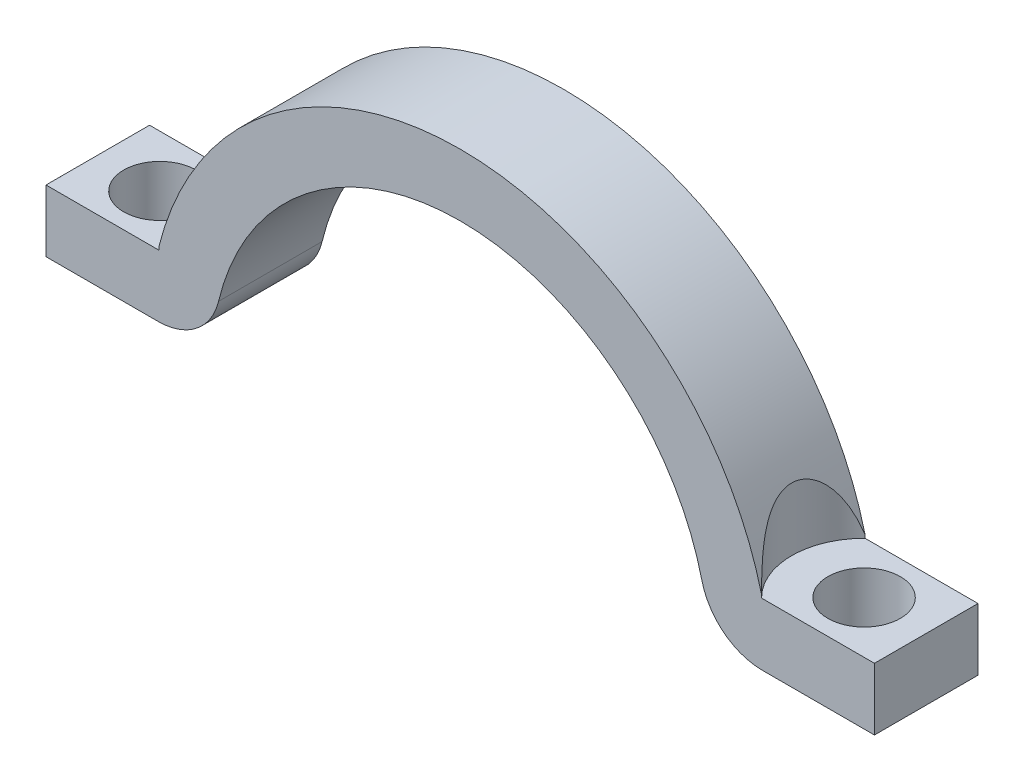
ISO-10303-21;
HEADER;
FILE_DESCRIPTION(('STEP AP214'),'2;1');
FILE_NAME('part.step','',(''),(''),'','','');
FILE_SCHEMA(('AUTOMOTIVE_DESIGN { 1 0 10303 214 1 1 1 1 }'));
ENDSEC;
DATA;
#1=APPLICATION_CONTEXT('core data for automotive mechanical design processes');
#2=APPLICATION_PROTOCOL_DEFINITION('international standard','automotive_design',2000,#1);
#3=PRODUCT_CONTEXT('',#1,'mechanical');
#4=PRODUCT('Part','Part','',(#3));
#5=PRODUCT_RELATED_PRODUCT_CATEGORY('part','',(#4));
#6=PRODUCT_DEFINITION_FORMATION('','',#4);
#7=PRODUCT_DEFINITION_CONTEXT('part definition',#1,'design');
#8=PRODUCT_DEFINITION('design','',#6,#7);
#9=PRODUCT_DEFINITION_SHAPE('','',#8);
#10=(LENGTH_UNIT() NAMED_UNIT(*) SI_UNIT(.MILLI.,.METRE.));
#11=(NAMED_UNIT(*) PLANE_ANGLE_UNIT() SI_UNIT($,.RADIAN.));
#12=(NAMED_UNIT(*) SI_UNIT($,.STERADIAN.) SOLID_ANGLE_UNIT());
#13=UNCERTAINTY_MEASURE_WITH_UNIT(LENGTH_MEASURE(1.E-05),#10,'distance_accuracy_value','');
#14=(GEOMETRIC_REPRESENTATION_CONTEXT(3) GLOBAL_UNCERTAINTY_ASSIGNED_CONTEXT((#13)) GLOBAL_UNIT_ASSIGNED_CONTEXT((#10,
#11,#12)) REPRESENTATION_CONTEXT('',''));
#15=CARTESIAN_POINT('',(0.,0.,0.));
#16=DIRECTION('',(0.,0.,1.));
#17=DIRECTION('',(1.,0.,0.));
#18=AXIS2_PLACEMENT_3D('',#15,#16,#17);
#19=CARTESIAN_POINT('',(0.,0.,5.));
#20=DIRECTION('',(0.,0.,-1.));
#21=DIRECTION('',(-1.,0.,0.));
#22=AXIS2_PLACEMENT_3D('',#19,#20,#21);
#23=CYLINDRICAL_SURFACE('',#22,15.);
#24=CARTESIAN_POINT('',(-14.5505102572168,3.64453717975658,5.));
#25=CARTESIAN_POINT('',(-14.5332017477214,3.71364155458008,4.9830385620535));
#26=CARTESIAN_POINT('',(-14.5154459793174,3.78243903254171,4.96529221262155));
#27=CARTESIAN_POINT('',(-14.4790773274704,3.91935414906099,4.92809138922797));
#28=CARTESIAN_POINT('',(-14.4604643071401,3.98747167691536,4.9086366420138));
#29=CARTESIAN_POINT('',(-14.4032941620975,4.19106342062497,4.84739308114929));
#30=CARTESIAN_POINT('',(-14.3635064084288,4.3253766282367,4.80282135011799));
#31=CARTESIAN_POINT('',(-14.2807586280169,4.59124169192534,4.70451749331513));
#32=CARTESIAN_POINT('',(-14.2377715500515,4.72275407211924,4.65070062319634));
#33=CARTESIAN_POINT('',(-14.1497873943112,4.98015772125556,4.53265991445644));
#34=CARTESIAN_POINT('',(-14.1047931708663,5.10605649358292,4.46845053332339));
#35=CARTESIAN_POINT('',(-14.016810741677,5.34264981160169,4.33213993110226));
#36=CARTESIAN_POINT('',(-13.9738782983576,5.45380178235096,4.26080615055534));
#37=CARTESIAN_POINT('',(-13.8886991095937,5.66720447718455,4.10550398566877));
#38=CARTESIAN_POINT('',(-13.8464518445122,5.76946223070995,4.02154572482591));
#39=CARTESIAN_POINT('',(-13.7642719373838,5.96288337816834,3.83802615849403));
#40=CARTESIAN_POINT('',(-13.7243742887272,6.05389430561389,3.73828510544011));
#41=CARTESIAN_POINT('',(-13.6508729963699,6.21785520688011,3.52283232351416));
#42=CARTESIAN_POINT('',(-13.6172520114597,6.2908551268749,3.40716617835421));
#43=CARTESIAN_POINT('',(-13.5702302674307,6.39146645187263,3.20262126881797));
#44=CARTESIAN_POINT('',(-13.5538351366026,6.42608083965871,3.11788336426263));
#45=CARTESIAN_POINT('',(-13.5270615156381,6.48225121807607,2.94325230391907));
#46=CARTESIAN_POINT('',(-13.5166780702719,6.50381796410004,2.85336346123965));
#47=CARTESIAN_POINT('',(-13.5029312557444,6.53231305832787,2.67022623393805));
#48=CARTESIAN_POINT('',(-13.4996056529568,6.53916265778559,2.57696247829133));
#49=CARTESIAN_POINT('',(-13.5004694257213,6.53737915363184,2.39061691234214));
#50=CARTESIAN_POINT('',(-13.5046587147384,6.52874622830341,2.29753509995692));
#51=CARTESIAN_POINT('',(-13.5195076173463,6.49793556486492,2.12127119757174));
#52=CARTESIAN_POINT('',(-13.5296745237834,6.47678852372079,2.03786145096804));
#53=CARTESIAN_POINT('',(-13.5551660304003,6.42326621076579,1.87559823737957));
#54=CARTESIAN_POINT('',(-13.5704926466603,6.39088654982476,1.79674656552782));
#55=CARTESIAN_POINT('',(-13.6126819757261,6.30065826268879,1.61202408661782));
#56=CARTESIAN_POINT('',(-13.6416730155296,6.23784253907853,1.50907231472503));
#57=CARTESIAN_POINT('',(-13.7049356258903,6.09759404717619,1.3155234339313));
#58=CARTESIAN_POINT('',(-13.7392174531868,6.02013281997137,1.22495098078699));
#59=CARTESIAN_POINT('',(-13.8026689115106,5.87292740455566,1.07445819418476));
#60=CARTESIAN_POINT('',(-13.8312841426306,5.80528700450404,1.01219663775289));
#61=CARTESIAN_POINT('',(-13.8894037664704,5.66482467078007,0.894222965709068));
#62=CARTESIAN_POINT('',(-13.9189086915158,5.59199959805031,0.838514872959511));
#63=CARTESIAN_POINT('',(-13.9782758253267,5.44190706337277,0.732834772364581));
#64=CARTESIAN_POINT('',(-14.0081390618928,5.3646203153155,0.682890980676028));
#65=CARTESIAN_POINT('',(-14.0676016093279,5.2066987020518,0.588416030559594));
#66=CARTESIAN_POINT('',(-14.0972008370814,5.12606282473039,0.543886524545517));
#67=CARTESIAN_POINT('',(-14.1659208872327,4.93360200833995,0.445060054489938));
#68=CARTESIAN_POINT('',(-14.2047791668628,4.82066942164856,0.392740373494215));
#69=CARTESIAN_POINT('',(-14.280679419269,4.59095366776417,0.295666765375892));
#70=CARTESIAN_POINT('',(-14.3177201998555,4.47416805498708,0.250917758356717));
#71=CARTESIAN_POINT('',(-14.3888609473772,4.23974061265434,0.168720096633533));
#72=CARTESIAN_POINT('',(-14.4230016822959,4.12215151510746,0.131155118982072));
#73=CARTESIAN_POINT('',(-14.4887257662519,3.88484640823665,0.0616125563022508));
#74=CARTESIAN_POINT('',(-14.5203132038743,3.76513418924113,0.0296259396020002));
#75=CARTESIAN_POINT('',(-14.5505102572168,3.64453717975663,-1.13071159563433E-13));
#76=B_SPLINE_CURVE_WITH_KNOTS('',3,(#24,#25,#26,#27,#28,#29,#30,#31,#32,#33,#34,#35,#36,#37,#38,
#39,#40,#41,#42,#43,#44,#45,#46,#47,#48,#49,#50,#51,#52,#53,#54,#55,#56,#57,#58,#59,#60,#61,#62,
#63,#64,#65,#66,#67,#68,#69,#70,#71,#72,#73,#74,#75),.UNSPECIFIED.,.F.,.F.,(4,2,2,2,2,2,2,2,2,2,
2,2,2,2,2,2,2,2,2,2,2,2,2,2,2,4),(0.,0.219678872328356,0.439392945783616,0.880090332717774,
1.32506685514335,1.76942958892741,2.18537073101124,2.60098009375129,3.02171779309404,
3.44127529261352,3.71917894512217,3.99685320368751,4.27600958380653,4.5551627494287,
4.81401466033658,5.07296783140208,5.44300110174214,5.81376094582375,6.10222083778716,
6.39085688777271,6.68085072443876,6.97093284484435,7.36173982413287,7.75279981727578,
8.13686088854765,8.52029425157584),.UNSPECIFIED.);
#77=CARTESIAN_POINT('',(-14.5505102572168,3.64453717975658,5.));
#78=VERTEX_POINT('',#77);
#79=CARTESIAN_POINT('',(-14.5505102572168,3.64453717975658,0.));
#80=VERTEX_POINT('',#79);
#81=EDGE_CURVE('E208',#78,#80,#76,.T.);
#82=ORIENTED_EDGE('',*,*,#81,.F.);
#83=CARTESIAN_POINT('',(0.,0.,5.));
#84=DIRECTION('',(0.,0.,1.));
#85=DIRECTION('',(1.,0.,0.));
#86=AXIS2_PLACEMENT_3D('',#83,#84,#85);
#87=CIRCLE('',#86,15.);
#88=CARTESIAN_POINT('',(14.5505102572168,3.64453717975658,5.));
#89=VERTEX_POINT('',#88);
#90=EDGE_CURVE('E204',#89,#78,#87,.T.);
#91=ORIENTED_EDGE('',*,*,#90,.F.);
#92=CARTESIAN_POINT('',(14.5505102572168,3.64453717975658,0.));
#93=CARTESIAN_POINT('',(14.5332017477214,3.71364155458008,0.0169614379464945));
#94=CARTESIAN_POINT('',(14.5154459793174,3.78243903254171,0.0347077873784458));
#95=CARTESIAN_POINT('',(14.4790773274704,3.91935414906099,0.0719086107720343));
#96=CARTESIAN_POINT('',(14.4604643071401,3.98747167691536,0.0913633579862049));
#97=CARTESIAN_POINT('',(14.4032941620975,4.19106342062497,0.152606918850714));
#98=CARTESIAN_POINT('',(14.3635064084288,4.3253766282367,0.197178649882013));
#99=CARTESIAN_POINT('',(14.2807586280169,4.59124169192534,0.295482506684866));
#100=CARTESIAN_POINT('',(14.2377715500515,4.72275407211924,0.349299376803656));
#101=CARTESIAN_POINT('',(14.1497873943112,4.98015772125557,0.467340085543562));
#102=CARTESIAN_POINT('',(14.1047931708663,5.10605649358293,0.531549466676609));
#103=CARTESIAN_POINT('',(14.016810741677,5.34264981160169,0.667860068897744));
#104=CARTESIAN_POINT('',(13.9738782983576,5.45380178235096,0.739193849444658));
#105=CARTESIAN_POINT('',(13.8886991095937,5.66720447718455,0.894496014331229));
#106=CARTESIAN_POINT('',(13.8464518445122,5.76946223070995,0.97845427517409));
#107=CARTESIAN_POINT('',(13.7642719373838,5.96288337816834,1.16197384150596));
#108=CARTESIAN_POINT('',(13.7243742887272,6.05389430561389,1.26171489455989));
#109=CARTESIAN_POINT('',(13.6508729963699,6.21785520688011,1.47716767648584));
#110=CARTESIAN_POINT('',(13.6172520114597,6.2908551268749,1.59283382164579));
#111=CARTESIAN_POINT('',(13.5702302674307,6.39146645187263,1.79737873118203));
#112=CARTESIAN_POINT('',(13.5538351366026,6.42608083965872,1.88211663573737));
#113=CARTESIAN_POINT('',(13.5270615156381,6.48225121807607,2.05674769608093));
#114=CARTESIAN_POINT('',(13.5166780702719,6.50381796410004,2.14663653876035));
#115=CARTESIAN_POINT('',(13.5029312557444,6.53231305832787,2.32977376606195));
#116=CARTESIAN_POINT('',(13.4996056529568,6.53916265778559,2.42303752170867));
#117=CARTESIAN_POINT('',(13.5004694257213,6.53737915363184,2.60938308765786));
#118=CARTESIAN_POINT('',(13.5046587147384,6.52874622830341,2.70246490004308));
#119=CARTESIAN_POINT('',(13.5195076173463,6.49793556486492,2.87872880242826));
#120=CARTESIAN_POINT('',(13.5296745237834,6.47678852372079,2.96213854903196));
#121=CARTESIAN_POINT('',(13.5551660304003,6.4232662107658,3.12440176262043));
#122=CARTESIAN_POINT('',(13.5704926466603,6.39088654982476,3.20325343447218));
#123=CARTESIAN_POINT('',(13.6126819757261,6.30065826268879,3.38797591338218));
#124=CARTESIAN_POINT('',(13.6416730155296,6.23784253907853,3.49092768527497));
#125=CARTESIAN_POINT('',(13.7049356258903,6.09759404717619,3.6844765660687));
#126=CARTESIAN_POINT('',(13.7392174531868,6.02013281997137,3.77504901921301));
#127=CARTESIAN_POINT('',(13.8026689115106,5.87292740455566,3.92554180581524));
#128=CARTESIAN_POINT('',(13.8312841426306,5.80528700450404,3.98780336224711));
#129=CARTESIAN_POINT('',(13.8894037664704,5.66482467078007,4.10577703429093));
#130=CARTESIAN_POINT('',(13.9189086915158,5.59199959805031,4.16148512704049));
#131=CARTESIAN_POINT('',(13.9782758253267,5.44190706337277,4.26716522763542));
#132=CARTESIAN_POINT('',(14.0081390618928,5.3646203153155,4.31710901932397));
#133=CARTESIAN_POINT('',(14.0676016093279,5.20669870205181,4.41158396944041));
#134=CARTESIAN_POINT('',(14.0972008370814,5.1260628247304,4.45611347545448));
#135=CARTESIAN_POINT('',(14.1659208872327,4.93360200833995,4.55493994551006));
#136=CARTESIAN_POINT('',(14.2047791668628,4.82066942164857,4.60725962650579));
#137=CARTESIAN_POINT('',(14.280679419269,4.59095366776417,4.70433323462411));
#138=CARTESIAN_POINT('',(14.3177201998555,4.47416805498708,4.74908224164328));
#139=CARTESIAN_POINT('',(14.3888609473772,4.23974061265435,4.83127990336647));
#140=CARTESIAN_POINT('',(14.4230016822959,4.12215151510746,4.86884488101793));
#141=CARTESIAN_POINT('',(14.4887257662519,3.88484640823665,4.93838744369775));
#142=CARTESIAN_POINT('',(14.5203132038743,3.76513418924113,4.970374060398));
#143=CARTESIAN_POINT('',(14.5505102572168,3.64453717975663,5.00000000000011));
#144=B_SPLINE_CURVE_WITH_KNOTS('',3,(#92,#93,#94,#95,#96,#97,#98,#99,#100,#101,#102,#103,#104,
#105,#106,#107,#108,#109,#110,#111,#112,#113,#114,#115,#116,#117,#118,#119,#120,#121,#122,#123,
#124,#125,#126,#127,#128,#129,#130,#131,#132,#133,#134,#135,#136,#137,#138,#139,#140,#141,#142,
#143),.UNSPECIFIED.,.F.,.F.,(4,2,2,2,2,2,2,2,2,2,2,2,2,2,2,2,2,2,2,2,2,2,2,2,2,4),(0.,
0.219678872328356,0.439392945783617,0.880090332717775,1.32506685514335,1.76942958892741,
2.18537073101124,2.60098009375129,3.02171779309404,3.44127529261352,3.71917894512216,
3.99685320368751,4.27600958380653,4.5551627494287,4.81401466033658,5.07296783140208,
5.44300110174214,5.81376094582375,6.10222083778716,6.39085688777271,6.68085072443876,
6.97093284484434,7.36173982413286,7.75279981727578,8.13686088854764,8.52029425157584),.UNSPECIFIED.);
#145=CARTESIAN_POINT('',(14.5505102572168,3.64453717975658,0.));
#146=VERTEX_POINT('',#145);
#147=EDGE_CURVE('E193',#146,#89,#144,.T.);
#148=ORIENTED_EDGE('',*,*,#147,.F.);
#149=CARTESIAN_POINT('',(0.,0.,0.));
#150=DIRECTION('',(0.,0.,1.));
#151=DIRECTION('',(1.,0.,0.));
#152=AXIS2_PLACEMENT_3D('',#149,#150,#151);
#153=CIRCLE('',#152,15.);
#154=EDGE_CURVE('E154',#146,#80,#153,.T.);
#155=ORIENTED_EDGE('',*,*,#154,.T.);
#156=EDGE_LOOP('',(#82,#91,#148,#155));
#157=FACE_BOUND('',#156,.T.);
#158=ADVANCED_FACE('F33',(#157),#23,.T.);
#159=CARTESIAN_POINT('',(14.5859521458148,3.5,5.));
#160=DIRECTION('',(0.,0.,-1.));
#161=DIRECTION('',(-1.,0.,0.));
#162=AXIS2_PLACEMENT_3D('',#159,#160,#161);
#163=PLANE('',#162);
#164=DIRECTION('',(0.,-1.,0.));
#165=VECTOR('',#164,1.);
#166=CARTESIAN_POINT('',(-14.5505102572168,15.,5.));
#167=LINE('',#166,#165);
#168=CARTESIAN_POINT('',(-14.5505102572168,3.5,5.));
#169=VERTEX_POINT('',#168);
#170=EDGE_CURVE('E321',#169,#78,#167,.F.);
#171=ORIENTED_EDGE('',*,*,#170,.F.);
#172=DIRECTION('',(-1.,0.,0.));
#173=VECTOR('',#172,1.);
#174=CARTESIAN_POINT('',(-20.,3.5,5.));
#175=LINE('',#174,#173);
#176=CARTESIAN_POINT('',(-20.,3.5,5.));
#177=VERTEX_POINT('',#176);
#178=EDGE_CURVE('E326',#169,#177,#175,.T.);
#179=ORIENTED_EDGE('',*,*,#178,.T.);
#180=DIRECTION('',(0.,-1.,0.));
#181=VECTOR('',#180,1.);
#182=CARTESIAN_POINT('',(-20.,0.5,5.));
#183=LINE('',#182,#181);
#184=CARTESIAN_POINT('',(-20.,0.5,5.));
#185=VERTEX_POINT('',#184);
#186=EDGE_CURVE('E121',#177,#185,#183,.T.);
#187=ORIENTED_EDGE('',*,*,#186,.T.);
#188=DIRECTION('',(1.,0.,0.));
#189=VECTOR('',#188,1.);
#190=CARTESIAN_POINT('',(-20.,0.5,5.));
#191=LINE('',#190,#189);
#192=CARTESIAN_POINT('',(-14.5859521458148,0.5,5.));
#193=VERTEX_POINT('',#192);
#194=EDGE_CURVE('E113',#185,#193,#191,.T.);
#195=ORIENTED_EDGE('',*,*,#194,.T.);
#196=CARTESIAN_POINT('',(-14.5859521458148,3.5,5.));
#197=DIRECTION('',(0.,0.,1.));
#198=DIRECTION('',(-1.,0.,0.));
#199=AXIS2_PLACEMENT_3D('',#196,#197,#198);
#200=CIRCLE('',#199,3.);
#201=CARTESIAN_POINT('',(-11.6687617166519,2.8,5.));
#202=VERTEX_POINT('',#201);
#203=EDGE_CURVE('E118',#193,#202,#200,.T.);
#204=ORIENTED_EDGE('',*,*,#203,.T.);
#205=CARTESIAN_POINT('',(0.,0.,5.));
#206=DIRECTION('',(0.,0.,-1.));
#207=DIRECTION('',(1.,0.,0.));
#208=AXIS2_PLACEMENT_3D('',#205,#206,#207);
#209=CIRCLE('',#208,12.);
#210=CARTESIAN_POINT('',(11.6687617166519,2.8,5.));
#211=VERTEX_POINT('',#210);
#212=EDGE_CURVE('E56',#202,#211,#209,.T.);
#213=ORIENTED_EDGE('',*,*,#212,.T.);
#214=CARTESIAN_POINT('',(14.5859521458148,3.5,5.));
#215=DIRECTION('',(0.,0.,1.));
#216=DIRECTION('',(-1.,0.,0.));
#217=AXIS2_PLACEMENT_3D('',#214,#215,#216);
#218=CIRCLE('',#217,3.);
#219=CARTESIAN_POINT('',(14.5859521458148,0.5,5.));
#220=VERTEX_POINT('',#219);
#221=EDGE_CURVE('E164',#211,#220,#218,.T.);
#222=ORIENTED_EDGE('',*,*,#221,.T.);
#223=DIRECTION('',(1.,0.,0.));
#224=VECTOR('',#223,1.);
#225=CARTESIAN_POINT('',(14.5859521458148,0.5,5.));
#226=LINE('',#225,#224);
#227=CARTESIAN_POINT('',(20.,0.5,5.));
#228=VERTEX_POINT('',#227);
#229=EDGE_CURVE('E98',#220,#228,#226,.T.);
#230=ORIENTED_EDGE('',*,*,#229,.T.);
#231=DIRECTION('',(0.,1.,0.));
#232=VECTOR('',#231,1.);
#233=CARTESIAN_POINT('',(20.,0.5,5.));
#234=LINE('',#233,#232);
#235=CARTESIAN_POINT('',(20.,3.5,5.));
#236=VERTEX_POINT('',#235);
#237=EDGE_CURVE('E330',#228,#236,#234,.T.);
#238=ORIENTED_EDGE('',*,*,#237,.T.);
#239=DIRECTION('',(-1.,0.,0.));
#240=VECTOR('',#239,1.);
#241=CARTESIAN_POINT('',(20.,3.5,5.));
#242=LINE('',#241,#240);
#243=CARTESIAN_POINT('',(14.5505102572168,3.5,5.));
#244=VERTEX_POINT('',#243);
#245=EDGE_CURVE('E327',#236,#244,#242,.T.);
#246=ORIENTED_EDGE('',*,*,#245,.T.);
#247=DIRECTION('',(0.,-1.,0.));
#248=VECTOR('',#247,1.);
#249=CARTESIAN_POINT('',(14.5505102572168,15.,5.));
#250=LINE('',#249,#248);
#251=EDGE_CURVE('E205',#89,#244,#250,.T.);
#252=ORIENTED_EDGE('',*,*,#251,.F.);
#253=ORIENTED_EDGE('',*,*,#90,.T.);
#254=EDGE_LOOP('',(#171,#179,#187,#195,#204,#213,#222,#230,#238,#246,#252,#253));
#255=FACE_BOUND('',#254,.T.);
#256=ADVANCED_FACE('F116',(#255),#163,.F.);
#257=CARTESIAN_POINT('',(14.5859521458148,3.5,0.));
#258=DIRECTION('',(0.,0.,-1.));
#259=DIRECTION('',(-1.,0.,0.));
#260=AXIS2_PLACEMENT_3D('',#257,#258,#259);
#261=PLANE('',#260);
#262=DIRECTION('',(-1.,0.,0.));
#263=VECTOR('',#262,1.);
#264=CARTESIAN_POINT('',(-20.,3.5,0.));
#265=LINE('',#264,#263);
#266=CARTESIAN_POINT('',(-14.5505102572168,3.5,0.));
#267=VERTEX_POINT('',#266);
#268=CARTESIAN_POINT('',(-20.,3.5,0.));
#269=VERTEX_POINT('',#268);
#270=EDGE_CURVE('E47',#267,#269,#265,.T.);
#271=ORIENTED_EDGE('',*,*,#270,.F.);
#272=DIRECTION('',(0.,-1.,0.));
#273=VECTOR('',#272,1.);
#274=CARTESIAN_POINT('',(-14.5505102572168,15.,0.));
#275=LINE('',#274,#273);
#276=EDGE_CURVE('E11',#267,#80,#275,.F.);
#277=ORIENTED_EDGE('',*,*,#276,.T.);
#278=ORIENTED_EDGE('',*,*,#154,.F.);
#279=DIRECTION('',(0.,-1.,0.));
#280=VECTOR('',#279,1.);
#281=CARTESIAN_POINT('',(14.5505102572168,15.,0.));
#282=LINE('',#281,#280);
#283=CARTESIAN_POINT('',(14.5505102572168,3.5,0.));
#284=VERTEX_POINT('',#283);
#285=EDGE_CURVE('E41',#146,#284,#282,.T.);
#286=ORIENTED_EDGE('',*,*,#285,.T.);
#287=DIRECTION('',(-1.,0.,0.));
#288=VECTOR('',#287,1.);
#289=CARTESIAN_POINT('',(20.,3.5,0.));
#290=LINE('',#289,#288);
#291=CARTESIAN_POINT('',(20.,3.5,0.));
#292=VERTEX_POINT('',#291);
#293=EDGE_CURVE('E151',#292,#284,#290,.T.);
#294=ORIENTED_EDGE('',*,*,#293,.F.);
#295=DIRECTION('',(0.,1.,0.));
#296=VECTOR('',#295,1.);
#297=CARTESIAN_POINT('',(20.,0.5,0.));
#298=LINE('',#297,#296);
#299=CARTESIAN_POINT('',(20.,0.5,0.));
#300=VERTEX_POINT('',#299);
#301=EDGE_CURVE('E148',#300,#292,#298,.T.);
#302=ORIENTED_EDGE('',*,*,#301,.F.);
#303=DIRECTION('',(1.,0.,0.));
#304=VECTOR('',#303,1.);
#305=CARTESIAN_POINT('',(14.5859521458148,0.5,0.));
#306=LINE('',#305,#304);
#307=CARTESIAN_POINT('',(14.5859521458148,0.5,0.));
#308=VERTEX_POINT('',#307);
#309=EDGE_CURVE('E145',#308,#300,#306,.T.);
#310=ORIENTED_EDGE('',*,*,#309,.F.);
#311=CARTESIAN_POINT('',(14.5859521458148,3.5,0.));
#312=DIRECTION('',(0.,0.,1.));
#313=DIRECTION('',(-1.,0.,0.));
#314=AXIS2_PLACEMENT_3D('',#311,#312,#313);
#315=CIRCLE('',#314,3.);
#316=CARTESIAN_POINT('',(11.6687617166519,2.8,0.));
#317=VERTEX_POINT('',#316);
#318=EDGE_CURVE('E142',#317,#308,#315,.T.);
#319=ORIENTED_EDGE('',*,*,#318,.F.);
#320=CARTESIAN_POINT('',(0.,0.,0.));
#321=DIRECTION('',(0.,0.,-1.));
#322=DIRECTION('',(1.,0.,0.));
#323=AXIS2_PLACEMENT_3D('',#320,#321,#322);
#324=CIRCLE('',#323,12.);
#325=CARTESIAN_POINT('',(-11.6687617166519,2.8,0.));
#326=VERTEX_POINT('',#325);
#327=EDGE_CURVE('E89',#326,#317,#324,.T.);
#328=ORIENTED_EDGE('',*,*,#327,.F.);
#329=CARTESIAN_POINT('',(-14.5859521458148,3.5,0.));
#330=DIRECTION('',(0.,0.,1.));
#331=DIRECTION('',(-1.,0.,0.));
#332=AXIS2_PLACEMENT_3D('',#329,#330,#331);
#333=CIRCLE('',#332,3.);
#334=CARTESIAN_POINT('',(-14.5859521458148,0.5,0.));
#335=VERTEX_POINT('',#334);
#336=EDGE_CURVE('E161',#335,#326,#333,.T.);
#337=ORIENTED_EDGE('',*,*,#336,.F.);
#338=DIRECTION('',(1.,0.,0.));
#339=VECTOR('',#338,1.);
#340=CARTESIAN_POINT('',(-20.,0.5,0.));
#341=LINE('',#340,#339);
#342=CARTESIAN_POINT('',(-20.,0.5,0.));
#343=VERTEX_POINT('',#342);
#344=EDGE_CURVE('E130',#343,#335,#341,.T.);
#345=ORIENTED_EDGE('',*,*,#344,.F.);
#346=DIRECTION('',(0.,-1.,0.));
#347=VECTOR('',#346,1.);
#348=CARTESIAN_POINT('',(-20.,0.5,0.));
#349=LINE('',#348,#347);
#350=EDGE_CURVE('E158',#269,#343,#349,.T.);
#351=ORIENTED_EDGE('',*,*,#350,.F.);
#352=EDGE_LOOP('',(#271,#277,#278,#286,#294,#302,#310,#319,#328,#337,#345,#351));
#353=FACE_BOUND('',#352,.T.);
#354=ADVANCED_FACE('F181',(#353),#261,.T.);
#355=CARTESIAN_POINT('',(14.5859521458148,3.5,5.));
#356=DIRECTION('',(0.,0.,-1.));
#357=DIRECTION('',(-1.,0.,0.));
#358=AXIS2_PLACEMENT_3D('',#355,#356,#357);
#359=CYLINDRICAL_SURFACE('',#358,3.);
#360=ORIENTED_EDGE('',*,*,#318,.T.);
#361=DIRECTION('',(0.,0.,-1.));
#362=VECTOR('',#361,1.);
#363=CARTESIAN_POINT('',(14.5859521458148,0.5,5.));
#364=LINE('',#363,#362);
#365=EDGE_CURVE('E175',#220,#308,#364,.T.);
#366=ORIENTED_EDGE('',*,*,#365,.F.);
#367=ORIENTED_EDGE('',*,*,#221,.F.);
#368=DIRECTION('',(0.,0.,-1.));
#369=VECTOR('',#368,1.);
#370=CARTESIAN_POINT('',(11.6687617166519,2.8,5.));
#371=LINE('',#370,#369);
#372=EDGE_CURVE('E138',#211,#317,#371,.T.);
#373=ORIENTED_EDGE('',*,*,#372,.T.);
#374=EDGE_LOOP('',(#360,#366,#367,#373));
#375=FACE_BOUND('',#374,.T.);
#376=ADVANCED_FACE('F35',(#375),#359,.T.);
#377=CARTESIAN_POINT('',(14.5859521458148,0.5,5.));
#378=DIRECTION('',(0.,1.,0.));
#379=DIRECTION('',(0.,0.,1.));
#380=AXIS2_PLACEMENT_3D('',#377,#378,#379);
#381=PLANE('',#380);
#382=CARTESIAN_POINT('',(17.,0.499999999999999,2.5));
#383=DIRECTION('',(0.,1.,0.));
#384=DIRECTION('',(0.,0.,1.));
#385=AXIS2_PLACEMENT_3D('',#382,#383,#384);
#386=CIRCLE('',#385,1.75);
#387=CARTESIAN_POINT('',(17.,0.499999999999999,4.25));
#388=VERTEX_POINT('',#387);
#389=EDGE_CURVE('E338',#388,#388,#386,.T.);
#390=ORIENTED_EDGE('',*,*,#389,.T.);
#391=EDGE_LOOP('',(#390));
#392=FACE_BOUND('',#391,.T.);
#393=ORIENTED_EDGE('',*,*,#309,.T.);
#394=DIRECTION('',(0.,0.,-1.));
#395=VECTOR('',#394,1.);
#396=CARTESIAN_POINT('',(20.,0.5,5.));
#397=LINE('',#396,#395);
#398=EDGE_CURVE('E172',#228,#300,#397,.T.);
#399=ORIENTED_EDGE('',*,*,#398,.F.);
#400=ORIENTED_EDGE('',*,*,#229,.F.);
#401=ORIENTED_EDGE('',*,*,#365,.T.);
#402=EDGE_LOOP('',(#393,#399,#400,#401));
#403=FACE_BOUND('',#402,.T.);
#404=ADVANCED_FACE('F283',(#392,#403),#381,.F.);
#405=CARTESIAN_POINT('',(20.,0.5,5.));
#406=DIRECTION('',(-1.,0.,0.));
#407=DIRECTION('',(0.,0.,1.));
#408=AXIS2_PLACEMENT_3D('',#405,#406,#407);
#409=PLANE('',#408);
#410=ORIENTED_EDGE('',*,*,#301,.T.);
#411=DIRECTION('',(0.,0.,-1.));
#412=VECTOR('',#411,1.);
#413=CARTESIAN_POINT('',(20.,3.5,5.));
#414=LINE('',#413,#412);
#415=EDGE_CURVE('E170',#236,#292,#414,.T.);
#416=ORIENTED_EDGE('',*,*,#415,.F.);
#417=ORIENTED_EDGE('',*,*,#237,.F.);
#418=ORIENTED_EDGE('',*,*,#398,.T.);
#419=EDGE_LOOP('',(#410,#416,#417,#418));
#420=FACE_BOUND('',#419,.T.);
#421=ADVANCED_FACE('F258',(#420),#409,.F.);
#422=CARTESIAN_POINT('',(20.,3.5,5.));
#423=DIRECTION('',(0.,-1.,0.));
#424=DIRECTION('',(1.,0.,0.));
#425=AXIS2_PLACEMENT_3D('',#422,#423,#424);
#426=PLANE('',#425);
#427=ORIENTED_EDGE('',*,*,#415,.T.);
#428=ORIENTED_EDGE('',*,*,#293,.T.);
#429=CARTESIAN_POINT('',(17.,3.5,2.5));
#430=DIRECTION('',(0.,1.,0.));
#431=DIRECTION('',(0.,0.,1.));
#432=AXIS2_PLACEMENT_3D('',#429,#430,#431);
#433=CIRCLE('',#432,3.5);
#434=EDGE_CURVE('E196',#284,#244,#433,.T.);
#435=ORIENTED_EDGE('',*,*,#434,.T.);
#436=ORIENTED_EDGE('',*,*,#245,.F.);
#437=EDGE_LOOP('',(#427,#428,#435,#436));
#438=FACE_BOUND('',#437,.T.);
#439=CARTESIAN_POINT('',(17.,3.5,2.5));
#440=DIRECTION('',(0.,1.,0.));
#441=DIRECTION('',(0.,0.,1.));
#442=AXIS2_PLACEMENT_3D('',#439,#440,#441);
#443=CIRCLE('',#442,1.75);
#444=CARTESIAN_POINT('',(17.,3.5,4.25));
#445=VERTEX_POINT('',#444);
#446=EDGE_CURVE('E323',#445,#445,#443,.T.);
#447=ORIENTED_EDGE('',*,*,#446,.F.);
#448=EDGE_LOOP('',(#447));
#449=FACE_BOUND('',#448,.T.);
#450=ADVANCED_FACE('F253',(#438,#449),#426,.F.);
#451=CARTESIAN_POINT('',(-20.,3.5,5.));
#452=DIRECTION('',(0.,-1.,0.));
#453=DIRECTION('',(0.,0.,-1.));
#454=AXIS2_PLACEMENT_3D('',#451,#452,#453);
#455=PLANE('',#454);
#456=DIRECTION('',(0.,0.,-1.));
#457=VECTOR('',#456,1.);
#458=CARTESIAN_POINT('',(-20.,3.5,5.));
#459=LINE('',#458,#457);
#460=EDGE_CURVE('E168',#177,#269,#459,.T.);
#461=ORIENTED_EDGE('',*,*,#460,.F.);
#462=ORIENTED_EDGE('',*,*,#178,.F.);
#463=CARTESIAN_POINT('',(-17.,3.5,2.5));
#464=DIRECTION('',(0.,1.,0.));
#465=DIRECTION('',(0.,0.,1.));
#466=AXIS2_PLACEMENT_3D('',#463,#464,#465);
#467=CIRCLE('',#466,3.5);
#468=EDGE_CURVE('E206',#169,#267,#467,.T.);
#469=ORIENTED_EDGE('',*,*,#468,.T.);
#470=ORIENTED_EDGE('',*,*,#270,.T.);
#471=EDGE_LOOP('',(#461,#462,#469,#470));
#472=FACE_BOUND('',#471,.T.);
#473=CARTESIAN_POINT('',(-17.,3.5,2.5));
#474=DIRECTION('',(0.,1.,0.));
#475=DIRECTION('',(0.,0.,1.));
#476=AXIS2_PLACEMENT_3D('',#473,#474,#475);
#477=CIRCLE('',#476,1.75);
#478=CARTESIAN_POINT('',(-17.,3.5,4.25));
#479=VERTEX_POINT('',#478);
#480=EDGE_CURVE('E341',#479,#479,#477,.T.);
#481=ORIENTED_EDGE('',*,*,#480,.F.);
#482=EDGE_LOOP('',(#481));
#483=FACE_BOUND('',#482,.T.);
#484=ADVANCED_FACE('F250',(#472,#483),#455,.F.);
#485=CARTESIAN_POINT('',(-20.,0.5,5.));
#486=DIRECTION('',(1.,0.,0.));
#487=DIRECTION('',(0.,0.,-1.));
#488=AXIS2_PLACEMENT_3D('',#485,#486,#487);
#489=PLANE('',#488);
#490=ORIENTED_EDGE('',*,*,#350,.T.);
#491=DIRECTION('',(0.,0.,-1.));
#492=VECTOR('',#491,1.);
#493=CARTESIAN_POINT('',(-20.,0.5,5.));
#494=LINE('',#493,#492);
#495=EDGE_CURVE('E133',#185,#343,#494,.T.);
#496=ORIENTED_EDGE('',*,*,#495,.F.);
#497=ORIENTED_EDGE('',*,*,#186,.F.);
#498=ORIENTED_EDGE('',*,*,#460,.T.);
#499=EDGE_LOOP('',(#490,#496,#497,#498));
#500=FACE_BOUND('',#499,.T.);
#501=ADVANCED_FACE('F247',(#500),#489,.F.);
#502=CARTESIAN_POINT('',(-20.,0.5,5.));
#503=DIRECTION('',(0.,1.,0.));
#504=DIRECTION('',(0.,0.,1.));
#505=AXIS2_PLACEMENT_3D('',#502,#503,#504);
#506=PLANE('',#505);
#507=CARTESIAN_POINT('',(-17.,0.499999999999999,2.5));
#508=DIRECTION('',(0.,1.,0.));
#509=DIRECTION('',(0.,0.,1.));
#510=AXIS2_PLACEMENT_3D('',#507,#508,#509);
#511=CIRCLE('',#510,1.75);
#512=CARTESIAN_POINT('',(-17.,0.499999999999999,4.25));
#513=VERTEX_POINT('',#512);
#514=EDGE_CURVE('E146',#513,#513,#511,.T.);
#515=ORIENTED_EDGE('',*,*,#514,.T.);
#516=EDGE_LOOP('',(#515));
#517=FACE_BOUND('',#516,.T.);
#518=ORIENTED_EDGE('',*,*,#344,.T.);
#519=DIRECTION('',(0.,0.,-1.));
#520=VECTOR('',#519,1.);
#521=CARTESIAN_POINT('',(-14.5859521458148,0.5,5.));
#522=LINE('',#521,#520);
#523=EDGE_CURVE('E127',#193,#335,#522,.T.);
#524=ORIENTED_EDGE('',*,*,#523,.F.);
#525=ORIENTED_EDGE('',*,*,#194,.F.);
#526=ORIENTED_EDGE('',*,*,#495,.T.);
#527=EDGE_LOOP('',(#518,#524,#525,#526));
#528=FACE_BOUND('',#527,.T.);
#529=ADVANCED_FACE('F128',(#517,#528),#506,.F.);
#530=CARTESIAN_POINT('',(-14.5859521458148,3.5,5.));
#531=DIRECTION('',(0.,0.,-1.));
#532=DIRECTION('',(-1.,0.,0.));
#533=AXIS2_PLACEMENT_3D('',#530,#531,#532);
#534=CYLINDRICAL_SURFACE('',#533,3.);
#535=ORIENTED_EDGE('',*,*,#336,.T.);
#536=DIRECTION('',(0.,0.,-1.));
#537=VECTOR('',#536,1.);
#538=CARTESIAN_POINT('',(-11.6687617166519,2.8,5.));
#539=LINE('',#538,#537);
#540=EDGE_CURVE('E134',#202,#326,#539,.T.);
#541=ORIENTED_EDGE('',*,*,#540,.F.);
#542=ORIENTED_EDGE('',*,*,#203,.F.);
#543=ORIENTED_EDGE('',*,*,#523,.T.);
#544=EDGE_LOOP('',(#535,#541,#542,#543));
#545=FACE_BOUND('',#544,.T.);
#546=ADVANCED_FACE('F136',(#545),#534,.T.);
#547=CARTESIAN_POINT('',(0.,0.,5.));
#548=DIRECTION('',(0.,0.,-1.));
#549=DIRECTION('',(-1.,0.,0.));
#550=AXIS2_PLACEMENT_3D('',#547,#548,#549);
#551=CYLINDRICAL_SURFACE('',#550,12.);
#552=ORIENTED_EDGE('',*,*,#327,.T.);
#553=ORIENTED_EDGE('',*,*,#372,.F.);
#554=ORIENTED_EDGE('',*,*,#212,.F.);
#555=ORIENTED_EDGE('',*,*,#540,.T.);
#556=EDGE_LOOP('',(#552,#553,#554,#555));
#557=FACE_BOUND('',#556,.T.);
#558=ADVANCED_FACE('F232',(#557),#551,.F.);
#559=CARTESIAN_POINT('',(-17.,0.499999999999999,2.5));
#560=DIRECTION('',(0.,1.,0.));
#561=DIRECTION('',(0.,0.,1.));
#562=AXIS2_PLACEMENT_3D('',#559,#560,#561);
#563=CYLINDRICAL_SURFACE('',#562,1.75);
#564=ORIENTED_EDGE('',*,*,#514,.F.);
#565=EDGE_LOOP('',(#564));
#566=FACE_BOUND('',#565,.T.);
#567=ORIENTED_EDGE('',*,*,#480,.T.);
#568=EDGE_LOOP('',(#567));
#569=FACE_BOUND('',#568,.T.);
#570=ADVANCED_FACE('F229',(#566,#569),#563,.F.);
#571=CARTESIAN_POINT('',(17.,0.499999999999999,2.5));
#572=DIRECTION('',(0.,1.,0.));
#573=DIRECTION('',(0.,0.,1.));
#574=AXIS2_PLACEMENT_3D('',#571,#572,#573);
#575=CYLINDRICAL_SURFACE('',#574,1.75);
#576=ORIENTED_EDGE('',*,*,#389,.F.);
#577=EDGE_LOOP('',(#576));
#578=FACE_BOUND('',#577,.T.);
#579=ORIENTED_EDGE('',*,*,#446,.T.);
#580=EDGE_LOOP('',(#579));
#581=FACE_BOUND('',#580,.T.);
#582=ADVANCED_FACE('F227',(#578,#581),#575,.F.);
#583=CARTESIAN_POINT('',(17.,15.,2.5));
#584=DIRECTION('',(0.,-1.,0.));
#585=DIRECTION('',(0.,0.,-1.));
#586=AXIS2_PLACEMENT_3D('',#583,#584,#585);
#587=CYLINDRICAL_SURFACE('',#586,3.5);
#588=ORIENTED_EDGE('',*,*,#251,.T.);
#589=ORIENTED_EDGE('',*,*,#434,.F.);
#590=ORIENTED_EDGE('',*,*,#285,.F.);
#591=ORIENTED_EDGE('',*,*,#147,.T.);
#592=EDGE_LOOP('',(#588,#589,#590,#591));
#593=FACE_BOUND('',#592,.T.);
#594=ADVANCED_FACE('F191',(#593),#587,.F.);
#595=CARTESIAN_POINT('',(-17.,15.,2.5));
#596=DIRECTION('',(0.,-1.,0.));
#597=DIRECTION('',(0.,0.,-1.));
#598=AXIS2_PLACEMENT_3D('',#595,#596,#597);
#599=CYLINDRICAL_SURFACE('',#598,3.5);
#600=ORIENTED_EDGE('',*,*,#170,.T.);
#601=ORIENTED_EDGE('',*,*,#81,.T.);
#602=ORIENTED_EDGE('',*,*,#276,.F.);
#603=ORIENTED_EDGE('',*,*,#468,.F.);
#604=EDGE_LOOP('',(#600,#601,#602,#603));
#605=FACE_BOUND('',#604,.T.);
#606=ADVANCED_FACE('F226',(#605),#599,.F.);
#607=CLOSED_SHELL('',(#158,#256,#354,#376,#404,#421,#450,#484,#501,#529,#546,#558,#570,#582,
#594,#606));
#608=MANIFOLD_SOLID_BREP('B2',#607);
#609=ADVANCED_BREP_SHAPE_REPRESENTATION('',(#18,#608),#14);
#610=SHAPE_DEFINITION_REPRESENTATION(#9,#609);
ENDSEC;
END-ISO-10303-21;
